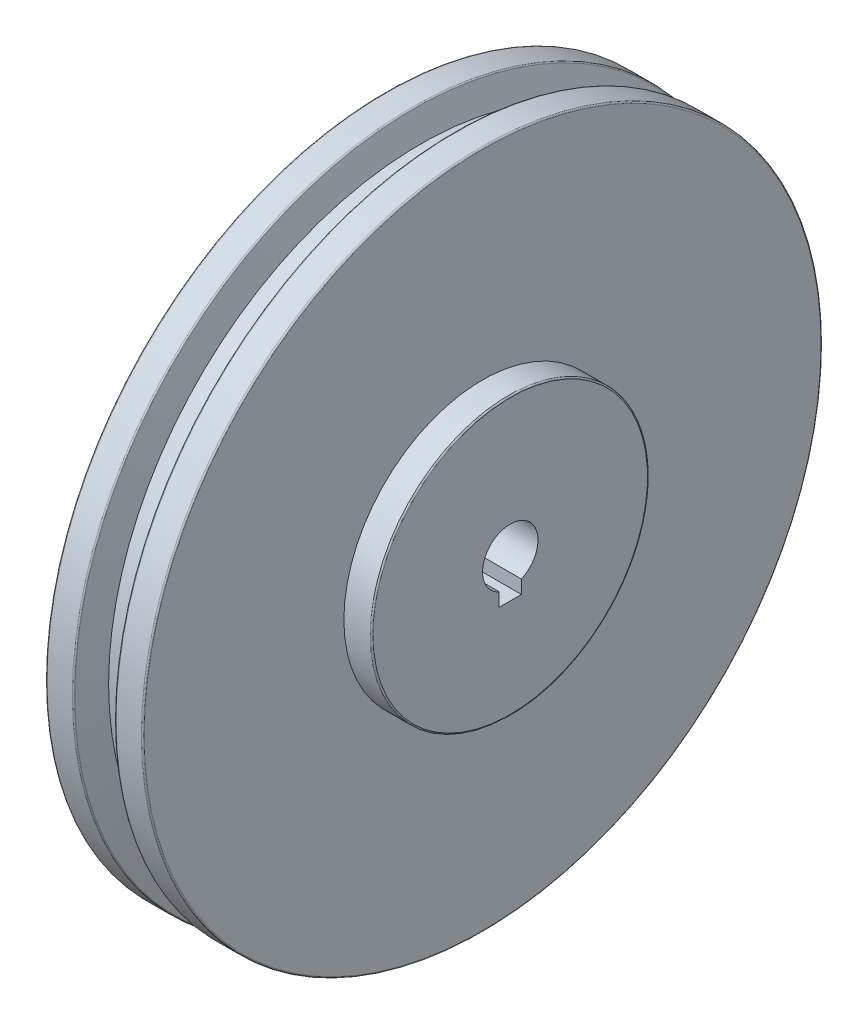
ISO-10303-21;
HEADER;
FILE_DESCRIPTION(('STEP AP214'),'2;1');
FILE_NAME('part.step','',(''),(''),'','','');
FILE_SCHEMA(('AUTOMOTIVE_DESIGN { 1 0 10303 214 1 1 1 1 }'));
ENDSEC;
DATA;
#1=APPLICATION_CONTEXT('core data for automotive mechanical design processes');
#2=APPLICATION_PROTOCOL_DEFINITION('international standard','automotive_design',2000,#1);
#3=PRODUCT_CONTEXT('',#1,'mechanical');
#4=PRODUCT('Part','Part','',(#3));
#5=PRODUCT_RELATED_PRODUCT_CATEGORY('part','',(#4));
#6=PRODUCT_DEFINITION_FORMATION('','',#4);
#7=PRODUCT_DEFINITION_CONTEXT('part definition',#1,'design');
#8=PRODUCT_DEFINITION('design','',#6,#7);
#9=PRODUCT_DEFINITION_SHAPE('','',#8);
#10=(LENGTH_UNIT() NAMED_UNIT(*) SI_UNIT(.MILLI.,.METRE.));
#11=(NAMED_UNIT(*) PLANE_ANGLE_UNIT() SI_UNIT($,.RADIAN.));
#12=(NAMED_UNIT(*) SI_UNIT($,.STERADIAN.) SOLID_ANGLE_UNIT());
#13=UNCERTAINTY_MEASURE_WITH_UNIT(LENGTH_MEASURE(1.E-05),#10,'distance_accuracy_value','');
#14=(GEOMETRIC_REPRESENTATION_CONTEXT(3) GLOBAL_UNCERTAINTY_ASSIGNED_CONTEXT((#13)) GLOBAL_UNIT_ASSIGNED_CONTEXT((#10,
#11,#12)) REPRESENTATION_CONTEXT('',''));
#15=CARTESIAN_POINT('',(0.,0.,0.));
#16=DIRECTION('',(0.,0.,1.));
#17=DIRECTION('',(1.,0.,0.));
#18=AXIS2_PLACEMENT_3D('',#15,#16,#17);
#19=CARTESIAN_POINT('',(2.5,0.,0.));
#20=DIRECTION('',(-1.,0.,0.));
#21=DIRECTION('',(0.,0.,1.));
#22=AXIS2_PLACEMENT_3D('',#19,#20,#21);
#23=CONICAL_SURFACE('',#22,10.,1.32581766366803);
#24=CARTESIAN_POINT('',(3.9982091334502,0.239497483998777,-4.));
#25=CARTESIAN_POINT('',(3.99949094210222,0.153874067113073,-4.));
#26=CARTESIAN_POINT('',(4.00008407993721,0.0682417266255501,-4.));
#27=CARTESIAN_POINT('',(3.99989702087461,-0.103020371462471,-4.));
#28=CARTESIAN_POINT('',(3.99911684151442,-0.188650129081989,-4.));
#29=CARTESIAN_POINT('',(3.99472310013969,-0.445464931331626,-4.));
#30=CARTESIAN_POINT('',(3.98905697783396,-0.616618759238255,-4.));
#31=CARTESIAN_POINT('',(3.97255266275997,-0.958361906247474,-4.));
#32=CARTESIAN_POINT('',(3.96172376166729,-1.12895168728123,-4.));
#33=CARTESIAN_POINT('',(3.9354004399075,-1.46977607446611,-4.));
#34=CARTESIAN_POINT('',(3.91990576144848,-1.64001066046866,-4.));
#35=CARTESIAN_POINT('',(3.88491349848852,-1.9795329334307,-4.));
#36=CARTESIAN_POINT('',(3.86542838707652,-2.14882192199654,-4.));
#37=CARTESIAN_POINT('',(3.8230443226964,-2.48696653471359,-4.));
#38=CARTESIAN_POINT('',(3.8001453990429,-2.65582216257344,-4.));
#39=CARTESIAN_POINT('',(3.7514931619618,-2.99321136452264,-4.));
#40=CARTESIAN_POINT('',(3.72573832003828,-3.16174471656856,-4.));
#41=CARTESIAN_POINT('',(3.67188320449087,-3.49843393520616,-4.));
#42=CARTESIAN_POINT('',(3.6437829319159,-3.66658980196661,-4.));
#43=CARTESIAN_POINT('',(3.5811609602192,-4.02856068825893,-4.));
#44=CARTESIAN_POINT('',(3.54631843748398,-4.22232001270321,-4.));
#45=CARTESIAN_POINT('',(3.47458420060922,-4.60945995883943,-4.));
#46=CARTESIAN_POINT('',(3.43769245490153,-4.80284057464985,-4.));
#47=CARTESIAN_POINT('',(3.32457410537635,-5.38252405884295,-4.));
#48=CARTESIAN_POINT('',(3.24590767658888,-5.76835006606814,-4.));
#49=CARTESIAN_POINT('',(3.08434301097601,-6.53908509686517,-4.));
#50=CARTESIAN_POINT('',(3.00144498038015,-6.92399416416948,-4.));
#51=CARTESIAN_POINT('',(2.83275823108083,-7.6931808752795,-4.));
#52=CARTESIAN_POINT('',(2.74696948235864,-8.07745851248461,-4.));
#53=CARTESIAN_POINT('',(2.57304572744791,-8.84696532269941,-4.));
#54=CARTESIAN_POINT('',(2.48490325790314,-9.23219280324941,-4.));
#55=CARTESIAN_POINT('',(2.30713409977689,-10.0023074018233,-4.));
#56=CARTESIAN_POINT('',(2.21750740089624,-10.3871945174658,-4.));
#57=CARTESIAN_POINT('',(1.94701138478034,-11.5414207532189,-4.));
#58=CARTESIAN_POINT('',(1.76451399424744,-12.3103779732623,-4.));
#59=CARTESIAN_POINT('',(1.44581148967251,-13.6434075397174,-4.));
#60=CARTESIAN_POINT('',(1.31019301606597,-14.2076207686432,-4.));
#61=CARTESIAN_POINT('',(1.03795243277761,-15.335805727838,-4.));
#62=CARTESIAN_POINT('',(0.901330322083348,-15.8997774578627,-4.));
#63=CARTESIAN_POINT('',(0.490372551565911,-17.5914572819046,-4.));
#64=CARTESIAN_POINT('',(0.214952258068573,-18.7189016820399,-4.));
#65=CARTESIAN_POINT('',(-0.335882183807941,-20.9665058719182,-4.));
#66=CARTESIAN_POINT('',(-0.611286131652636,-22.0866681655767,-4.));
#67=CARTESIAN_POINT('',(-1.02519143077604,-23.7666961745184,-4.));
#68=CARTESIAN_POINT('',(-1.16329094731863,-24.3266609305366,-4.));
#69=CARTESIAN_POINT('',(-1.4397123491927,-25.4465354051423,-4.));
#70=CARTESIAN_POINT('',(-1.57803423446698,-26.0064451237439,-4.));
#71=CARTESIAN_POINT('',(-1.71644459019244,-26.5663329597821,-4.));
#72=B_SPLINE_CURVE_WITH_KNOTS('',3,(#24,#25,#26,#27,#28,#29,#30,#31,#32,#33,#34,#35,#36,#37,#38,
#39,#40,#41,#42,#43,#44,#45,#46,#47,#48,#49,#50,#51,#52,#53,#54,#55,#56,#57,#58,#59,#60,#61,#62,
#63,#64,#65,#66,#67,#68,#69,#70,#71),.UNSPECIFIED.,.F.,.F.,(4,2,2,2,2,2,2,2,2,2,2,2,2,2,2,2,2,2,
2,2,2,2,2,4),(0.,0.256893529824105,0.513783779117827,1.02743456286781,1.54016437694349,
2.05292252538955,2.56410173536213,3.0752765560595,3.58672629165701,4.09817579852731,
4.68876292459129,5.27935915113827,6.46060795905571,7.64179925299349,8.82300281681761,
10.0085469531177,11.194099319443,13.5650403105444,15.3058902530148,17.046741951838,
20.528532750212,23.9890953920107,25.7193230936563,27.4495503503144),.UNSPECIFIED.);
#73=CARTESIAN_POINT('',(2.5,-9.16515138991168,-4.));
#74=VERTEX_POINT('',#73);
#75=CARTESIAN_POINT('',(1.35994505535974,-14.,-4.));
#76=VERTEX_POINT('',#75);
#77=EDGE_CURVE('E76',#74,#76,#72,.T.);
#78=ORIENTED_EDGE('',*,*,#77,.F.);
#79=CARTESIAN_POINT('',(2.5,0.,0.));
#80=DIRECTION('',(-1.,0.,0.));
#81=DIRECTION('',(0.,0.,1.));
#82=AXIS2_PLACEMENT_3D('',#79,#80,#81);
#83=CIRCLE('',#82,10.);
#84=CARTESIAN_POINT('',(2.5,-9.16515138991168,4.));
#85=VERTEX_POINT('',#84);
#86=EDGE_CURVE('E121',#85,#74,#83,.T.);
#87=ORIENTED_EDGE('',*,*,#86,.F.);
#88=CARTESIAN_POINT('',(-1.71644459019244,-26.5663329597821,4.));
#89=CARTESIAN_POINT('',(-1.57751969377818,-26.0043667723752,4.));
#90=CARTESIAN_POINT('',(-1.43868499306582,-25.4423783043008,4.));
#91=CARTESIAN_POINT('',(-1.16123979264955,-24.3183459035616,4.));
#92=CARTESIAN_POINT('',(-1.0226292929938,-23.7563019708847,4.));
#93=CARTESIAN_POINT('',(-0.607288678074337,-22.0704313359882,4.));
#94=CARTESIAN_POINT('',(-0.330960324651022,-20.9465055289346,4.));
#95=CARTESIAN_POINT('',(0.0821294794034745,-19.2608240092338,4.));
#96=CARTESIAN_POINT('',(0.219529000265815,-18.6992246777126,4.));
#97=CARTESIAN_POINT('',(0.493772689816105,-17.5758941779167,4.));
#98=CARTESIAN_POINT('',(0.630616862042874,-17.0141630105063,4.));
#99=CARTESIAN_POINT('',(0.903617140120429,-15.890351927177,4.));
#100=CARTESIAN_POINT('',(1.03977302333787,-15.3282719571445,4.));
#101=CARTESIAN_POINT('',(1.31109792963384,-14.2038597446444,4.));
#102=CARTESIAN_POINT('',(1.44626692946511,-13.6415274965631,4.));
#103=CARTESIAN_POINT('',(1.71190443452542,-12.5304024573386,4.));
#104=CARTESIAN_POINT('',(1.84240665654148,-11.9816177392138,4.));
#105=CARTESIAN_POINT('',(2.10150000005102,-10.8836455512106,4.));
#106=CARTESIAN_POINT('',(2.23009128117649,-10.334458119041,4.));
#107=CARTESIAN_POINT('',(2.48431808973877,-9.23591469077145,4.));
#108=CARTESIAN_POINT('',(2.60995616393847,-8.68655928729637,4.));
#109=CARTESIAN_POINT('',(2.79501440036432,-7.86167090201973,4.));
#110=CARTESIAN_POINT('',(2.85614345325827,-7.58652172450782,4.));
#111=CARTESIAN_POINT('',(2.97690982944825,-7.03589664987665,4.));
#112=CARTESIAN_POINT('',(3.03654715916062,-6.76042075416804,4.));
#113=CARTESIAN_POINT('',(3.15404729819923,-6.20820020881522,4.));
#114=CARTESIAN_POINT('',(3.21190405915624,-5.93145426811922,4.));
#115=CARTESIAN_POINT('',(3.32497988783636,-5.37742563860324,4.));
#116=CARTESIAN_POINT('',(3.38019899439789,-5.10014295774916,4.));
#117=CARTESIAN_POINT('',(3.48699754951729,-4.54513152584167,4.));
#118=CARTESIAN_POINT('',(3.5385802282393,-4.26740340063669,4.));
#119=CARTESIAN_POINT('',(3.6368012940884,-3.71103709337693,4.));
#120=CARTESIAN_POINT('',(3.68343922180667,-3.43239882923734,4.));
#121=CARTESIAN_POINT('',(3.77001140917091,-2.87304483489231,4.));
#122=CARTESIAN_POINT('',(3.80992103575625,-2.59232523808127,4.));
#123=CARTESIAN_POINT('',(3.88026936101606,-2.0297442741595,4.));
#124=CARTESIAN_POINT('',(3.91071093982709,-1.74788328073781,4.));
#125=CARTESIAN_POINT('',(3.94717948606759,-1.32385573252756,4.));
#126=CARTESIAN_POINT('',(3.95781286336694,-1.18208204216547,4.));
#127=CARTESIAN_POINT('',(3.97566723012114,-0.898319934403098,4.));
#128=CARTESIAN_POINT('',(3.9828883038966,-0.756331522395741,4.));
#129=CARTESIAN_POINT('',(3.99367170155033,-0.472061930913726,4.));
#130=CARTESIAN_POINT('',(3.99723009391394,-0.329780600766453,4.));
#131=CARTESIAN_POINT('',(4.00057456328787,-0.0451581924003093,4.));
#132=CARTESIAN_POINT('',(4.00036021993681,0.0971828907093948,4.));
#133=CARTESIAN_POINT('',(3.9982091334502,0.239497483998777,4.));
#134=B_SPLINE_CURVE_WITH_KNOTS('',3,(#88,#89,#90,#91,#92,#93,#94,#95,#96,#97,#98,#99,#100,#101,
#102,#103,#104,#105,#106,#107,#108,#109,#110,#111,#112,#113,#114,#115,#116,#117,#118,#119,#120,
#121,#122,#123,#124,#125,#126,#127,#128,#129,#130,#131,#132,#133),.UNSPECIFIED.,.F.,.F.,(4,2,2,
2,2,2,2,2,2,2,2,2,2,2,2,2,2,2,2,2,2,2,4),(0.,1.73665049204127,3.47330135715963,6.94548970452004,
8.67997845914833,10.4144561437719,12.1494629411391,13.8845104777251,15.5767725959689,
17.2688925459514,18.9594953364796,19.8050657824766,20.6506325908098,21.4988104952345,
22.3469759067211,23.194378161141,24.0418590774709,24.8923783344366,25.7426386137408,
26.1691196582863,26.5955901636103,27.0225179656139,27.4494933365723),.UNSPECIFIED.);
#135=CARTESIAN_POINT('',(1.35994505535974,-14.,4.));
#136=VERTEX_POINT('',#135);
#137=EDGE_CURVE('E48',#136,#85,#134,.T.);
#138=ORIENTED_EDGE('',*,*,#137,.F.);
#139=CARTESIAN_POINT('',(-0.594891303465912,-14.,-17.4598092532987));
#140=CARTESIAN_POINT('',(-0.477972715579384,-14.,-16.8601338890641));
#141=CARTESIAN_POINT('',(-0.363243172503584,-14.,-16.2600201503469));
#142=CARTESIAN_POINT('',(-0.139325616503206,-14.,-15.0587157594557));
#143=CARTESIAN_POINT('',(-0.0301380129904105,-14.,-14.4575250311057));
#144=CARTESIAN_POINT('',(0.181719173211806,-14.,-13.2527917699557));
#145=CARTESIAN_POINT('',(0.284375749699628,-14.,-12.6492469374648));
#146=CARTESIAN_POINT('',(0.481411871578671,-14.,-11.4408101833135));
#147=CARTESIAN_POINT('',(0.575791550070488,-14.,-10.8359182834757));
#148=CARTESIAN_POINT('',(0.753484434506258,-14.,-9.63120924080177));
#149=CARTESIAN_POINT('',(0.836906653915576,-14.,-9.03140829344529));
#150=CARTESIAN_POINT('',(0.991816572029047,-14.,-7.83027092000692));
#151=CARTESIAN_POINT('',(1.06330462555071,-14.,-7.22893454011522));
#152=CARTESIAN_POINT('',(1.19204784354924,-14.,-6.0252363726605));
#153=CARTESIAN_POINT('',(1.24931498707908,-14.,-5.42287588141449));
#154=CARTESIAN_POINT('',(1.34746133815216,-14.,-4.21680940724808));
#155=CARTESIAN_POINT('',(1.38834073742532,-14.,-3.6131034401523));
#156=CARTESIAN_POINT('',(1.45196506510539,-14.,-2.40183973962952));
#157=CARTESIAN_POINT('',(1.4746227797944,-14.,-1.79427734698979));
#158=CARTESIAN_POINT('',(1.50028301796892,-14.,-0.57873272586612));
#159=CARTESIAN_POINT('',(1.50328562343502,-14.,0.0292495008561282));
#160=CARTESIAN_POINT('',(1.4894644538347,-14.,1.24543634736847));
#161=CARTESIAN_POINT('',(1.4726259455166,-14.,1.85364079674026));
#162=CARTESIAN_POINT('',(1.42000768084097,-14.,3.06921490973008));
#163=CARTESIAN_POINT('',(1.38422793888616,-14.,3.67658457398253));
#164=CARTESIAN_POINT('',(1.29502128561865,-14.,4.89629777934016));
#165=CARTESIAN_POINT('',(1.24141639940646,-14.,5.50862811333251));
#166=CARTESIAN_POINT('',(1.11893548992387,-14.,6.73177923726777));
#167=CARTESIAN_POINT('',(1.05005846849383,-14.,7.34259992590323));
#168=CARTESIAN_POINT('',(0.899503005686127,-14.,8.56189526589394));
#169=CARTESIAN_POINT('',(0.817840208783739,-14.,9.17037186524913));
#170=CARTESIAN_POINT('',(0.687358843893016,-14.,10.081861928323));
#171=CARTESIAN_POINT('',(0.642538910998248,-14.,10.3854564619174));
#172=CARTESIAN_POINT('',(0.550477780967616,-14.,10.9922721314345));
#173=CARTESIAN_POINT('',(0.503236633691102,-14.,11.2954932749148));
#174=CARTESIAN_POINT('',(0.454905460304862,-14.,11.5985408563433));
#175=B_SPLINE_CURVE_WITH_KNOTS('',3,(#139,#140,#141,#142,#143,#144,#145,#146,#147,#148,#149,
#150,#151,#152,#153,#154,#155,#156,#157,#158,#159,#160,#161,#162,#163,#164,#165,#166,#167,#168,
#169,#170,#171,#172,#173,#174),.UNSPECIFIED.,.F.,.F.,(4,2,2,2,2,2,2,2,2,2,2,2,2,2,2,2,2,4),(0.,
1.83291351869371,3.66596224770601,5.50255396648862,7.33911614566646,9.1557408618982,
10.972311558008,12.7873468263189,14.6023608588383,16.4260111646082,18.2496538640086,
20.0746515845002,21.8996479172833,23.7434422441322,25.5873571136433,27.4290331803402,
28.3496807235931,29.2703093158355),.UNSPECIFIED.);
#176=EDGE_CURVE('E116',#76,#136,#175,.T.);
#177=ORIENTED_EDGE('',*,*,#176,.F.);
#178=EDGE_LOOP('',(#78,#87,#138,#177));
#179=FACE_BOUND('',#178,.T.);
#180=CARTESIAN_POINT('',(0.,0.,0.));
#181=DIRECTION('',(-1.,0.,0.));
#182=DIRECTION('',(0.,0.,1.));
#183=AXIS2_PLACEMENT_3D('',#180,#181,#182);
#184=CIRCLE('',#183,20.);
#185=CARTESIAN_POINT('',(0.,0.,20.));
#186=VERTEX_POINT('',#185);
#187=EDGE_CURVE('E164',#186,#186,#184,.T.);
#188=ORIENTED_EDGE('',*,*,#187,.T.);
#189=EDGE_LOOP('',(#188));
#190=FACE_BOUND('',#189,.T.);
#191=ADVANCED_FACE('F33',(#179,#190),#23,.F.);
#192=CARTESIAN_POINT('',(0.,-20.,0.));
#193=DIRECTION('',(-1.,0.,0.));
#194=DIRECTION('',(0.,0.,1.));
#195=AXIS2_PLACEMENT_3D('',#192,#193,#194);
#196=PLANE('',#195);
#197=CARTESIAN_POINT('',(0.,0.,0.));
#198=DIRECTION('',(-1.,0.,0.));
#199=DIRECTION('',(0.,0.,1.));
#200=AXIS2_PLACEMENT_3D('',#197,#198,#199);
#201=CIRCLE('',#200,122.);
#202=CARTESIAN_POINT('',(0.,0.,122.));
#203=VERTEX_POINT('',#202);
#204=EDGE_CURVE('E161',#203,#203,#201,.T.);
#205=ORIENTED_EDGE('',*,*,#204,.T.);
#206=EDGE_LOOP('',(#205));
#207=FACE_BOUND('',#206,.T.);
#208=ORIENTED_EDGE('',*,*,#187,.F.);
#209=EDGE_LOOP('',(#208));
#210=FACE_BOUND('',#209,.T.);
#211=ADVANCED_FACE('F172',(#207,#210),#196,.T.);
#212=CARTESIAN_POINT('',(0.500000000000013,0.,0.));
#213=DIRECTION('',(-1.,0.,0.));
#214=DIRECTION('',(0.,0.,1.));
#215=AXIS2_PLACEMENT_3D('',#212,#213,#214);
#216=TOROIDAL_SURFACE('',#215,122.,0.5);
#217=CARTESIAN_POINT('',(0.500000000000013,0.,0.));
#218=DIRECTION('',(-1.,0.,0.));
#219=DIRECTION('',(0.,0.,1.));
#220=AXIS2_PLACEMENT_3D('',#217,#218,#219);
#221=CIRCLE('',#220,122.5);
#222=CARTESIAN_POINT('',(0.500000000000013,0.,122.5));
#223=VERTEX_POINT('',#222);
#224=EDGE_CURVE('E158',#223,#223,#221,.T.);
#225=ORIENTED_EDGE('',*,*,#224,.T.);
#226=EDGE_LOOP('',(#225));
#227=FACE_BOUND('',#226,.T.);
#228=ORIENTED_EDGE('',*,*,#204,.F.);
#229=EDGE_LOOP('',(#228));
#230=FACE_BOUND('',#229,.T.);
#231=ADVANCED_FACE('F176',(#227,#230),#216,.T.);
#232=CARTESIAN_POINT('',(0.,0.,0.));
#233=DIRECTION('',(-1.,0.,0.));
#234=DIRECTION('',(0.,0.,1.));
#235=AXIS2_PLACEMENT_3D('',#232,#233,#234);
#236=CYLINDRICAL_SURFACE('',#235,122.5);
#237=CARTESIAN_POINT('',(9.61633650601052,0.,0.));
#238=DIRECTION('',(-1.,0.,0.));
#239=DIRECTION('',(0.,0.,1.));
#240=AXIS2_PLACEMENT_3D('',#237,#238,#239);
#241=CIRCLE('',#240,122.5);
#242=CARTESIAN_POINT('',(9.61633650601052,0.,122.5));
#243=VERTEX_POINT('',#242);
#244=EDGE_CURVE('E155',#243,#243,#241,.T.);
#245=ORIENTED_EDGE('',*,*,#244,.T.);
#246=EDGE_LOOP('',(#245));
#247=FACE_BOUND('',#246,.T.);
#248=ORIENTED_EDGE('',*,*,#224,.F.);
#249=EDGE_LOOP('',(#248));
#250=FACE_BOUND('',#249,.T.);
#251=ADVANCED_FACE('F181',(#247,#250),#236,.T.);
#252=CARTESIAN_POINT('',(9.61633650601052,0.,0.));
#253=DIRECTION('',(-1.,0.,0.));
#254=DIRECTION('',(0.,0.,1.));
#255=AXIS2_PLACEMENT_3D('',#252,#253,#254);
#256=TOROIDAL_SURFACE('',#255,122.,0.50000000000001);
#257=CARTESIAN_POINT('',(10.0992994191551,0.,0.));
#258=DIRECTION('',(-1.,0.,0.));
#259=DIRECTION('',(0.,0.,1.));
#260=AXIS2_PLACEMENT_3D('',#257,#258,#259);
#261=CIRCLE('',#260,122.129409522551);
#262=CARTESIAN_POINT('',(10.0992994191551,0.,122.129409522551));
#263=VERTEX_POINT('',#262);
#264=EDGE_CURVE('E152',#263,#263,#261,.T.);
#265=ORIENTED_EDGE('',*,*,#264,.T.);
#266=EDGE_LOOP('',(#265));
#267=FACE_BOUND('',#266,.T.);
#268=ORIENTED_EDGE('',*,*,#244,.F.);
#269=EDGE_LOOP('',(#268));
#270=FACE_BOUND('',#269,.T.);
#271=ADVANCED_FACE('F187',(#267,#270),#256,.T.);
#272=CARTESIAN_POINT('',(10.0992994191551,0.,0.));
#273=DIRECTION('',(-1.,0.,0.));
#274=DIRECTION('',(0.,0.,1.));
#275=AXIS2_PLACEMENT_3D('',#272,#273,#274);
#276=CONICAL_SURFACE('',#275,122.129409522551,1.30899693899575);
#277=CARTESIAN_POINT('',(12.6794919243112,0.,0.));
#278=DIRECTION('',(-1.,0.,0.));
#279=DIRECTION('',(0.,0.,1.));
#280=AXIS2_PLACEMENT_3D('',#277,#278,#279);
#281=CIRCLE('',#280,112.5);
#282=CARTESIAN_POINT('',(12.6794919243112,0.,112.5));
#283=VERTEX_POINT('',#282);
#284=EDGE_CURVE('E149',#283,#283,#281,.T.);
#285=ORIENTED_EDGE('',*,*,#284,.T.);
#286=EDGE_LOOP('',(#285));
#287=FACE_BOUND('',#286,.T.);
#288=ORIENTED_EDGE('',*,*,#264,.F.);
#289=EDGE_LOOP('',(#288));
#290=FACE_BOUND('',#289,.T.);
#291=ADVANCED_FACE('F191',(#287,#290),#276,.T.);
#292=CARTESIAN_POINT('',(0.,0.,0.));
#293=DIRECTION('',(-1.,0.,0.));
#294=DIRECTION('',(0.,0.,1.));
#295=AXIS2_PLACEMENT_3D('',#292,#293,#294);
#296=CYLINDRICAL_SURFACE('',#295,112.5);
#297=CARTESIAN_POINT('',(22.3205080756888,0.,0.));
#298=DIRECTION('',(-1.,0.,0.));
#299=DIRECTION('',(0.,0.,1.));
#300=AXIS2_PLACEMENT_3D('',#297,#298,#299);
#301=CIRCLE('',#300,112.5);
#302=CARTESIAN_POINT('',(22.3205080756888,0.,112.5));
#303=VERTEX_POINT('',#302);
#304=EDGE_CURVE('E146',#303,#303,#301,.T.);
#305=ORIENTED_EDGE('',*,*,#304,.T.);
#306=EDGE_LOOP('',(#305));
#307=FACE_BOUND('',#306,.T.);
#308=ORIENTED_EDGE('',*,*,#284,.F.);
#309=EDGE_LOOP('',(#308));
#310=FACE_BOUND('',#309,.T.);
#311=ADVANCED_FACE('F195',(#307,#310),#296,.T.);
#312=CARTESIAN_POINT('',(22.3205080756888,0.,0.));
#313=DIRECTION('',(1.,0.,0.));
#314=DIRECTION('',(0.,0.,-1.));
#315=AXIS2_PLACEMENT_3D('',#312,#313,#314);
#316=CONICAL_SURFACE('',#315,112.5,1.30899693899575);
#317=CARTESIAN_POINT('',(24.900700580845,0.,0.));
#318=DIRECTION('',(-1.,0.,0.));
#319=DIRECTION('',(0.,0.,1.));
#320=AXIS2_PLACEMENT_3D('',#317,#318,#319);
#321=CIRCLE('',#320,122.129409522551);
#322=CARTESIAN_POINT('',(24.900700580845,0.,122.129409522551));
#323=VERTEX_POINT('',#322);
#324=EDGE_CURVE('E143',#323,#323,#321,.T.);
#325=ORIENTED_EDGE('',*,*,#324,.T.);
#326=EDGE_LOOP('',(#325));
#327=FACE_BOUND('',#326,.T.);
#328=ORIENTED_EDGE('',*,*,#304,.F.);
#329=EDGE_LOOP('',(#328));
#330=FACE_BOUND('',#329,.T.);
#331=ADVANCED_FACE('F199',(#327,#330),#316,.T.);
#332=CARTESIAN_POINT('',(25.3836634939895,0.,0.));
#333=DIRECTION('',(-1.,0.,0.));
#334=DIRECTION('',(0.,0.,1.));
#335=AXIS2_PLACEMENT_3D('',#332,#333,#334);
#336=TOROIDAL_SURFACE('',#335,122.,0.500000000000012);
#337=CARTESIAN_POINT('',(25.3836634939895,0.,0.));
#338=DIRECTION('',(-1.,0.,0.));
#339=DIRECTION('',(0.,0.,1.));
#340=AXIS2_PLACEMENT_3D('',#337,#338,#339);
#341=CIRCLE('',#340,122.5);
#342=CARTESIAN_POINT('',(25.3836634939895,0.,122.5));
#343=VERTEX_POINT('',#342);
#344=EDGE_CURVE('E140',#343,#343,#341,.T.);
#345=ORIENTED_EDGE('',*,*,#344,.T.);
#346=EDGE_LOOP('',(#345));
#347=FACE_BOUND('',#346,.T.);
#348=ORIENTED_EDGE('',*,*,#324,.F.);
#349=EDGE_LOOP('',(#348));
#350=FACE_BOUND('',#349,.T.);
#351=ADVANCED_FACE('F203',(#347,#350),#336,.T.);
#352=CARTESIAN_POINT('',(0.,0.,0.));
#353=DIRECTION('',(-1.,0.,0.));
#354=DIRECTION('',(0.,0.,1.));
#355=AXIS2_PLACEMENT_3D('',#352,#353,#354);
#356=CYLINDRICAL_SURFACE('',#355,122.5);
#357=CARTESIAN_POINT('',(34.5,0.,0.));
#358=DIRECTION('',(-1.,0.,0.));
#359=DIRECTION('',(0.,0.,1.));
#360=AXIS2_PLACEMENT_3D('',#357,#358,#359);
#361=CIRCLE('',#360,122.5);
#362=CARTESIAN_POINT('',(34.5,0.,122.5));
#363=VERTEX_POINT('',#362);
#364=EDGE_CURVE('E137',#363,#363,#361,.T.);
#365=ORIENTED_EDGE('',*,*,#364,.T.);
#366=EDGE_LOOP('',(#365));
#367=FACE_BOUND('',#366,.T.);
#368=ORIENTED_EDGE('',*,*,#344,.F.);
#369=EDGE_LOOP('',(#368));
#370=FACE_BOUND('',#369,.T.);
#371=ADVANCED_FACE('F207',(#367,#370),#356,.T.);
#372=CARTESIAN_POINT('',(34.5,0.,0.));
#373=DIRECTION('',(-1.,0.,0.));
#374=DIRECTION('',(0.,0.,1.));
#375=AXIS2_PLACEMENT_3D('',#372,#373,#374);
#376=TOROIDAL_SURFACE('',#375,122.,0.500000000000007);
#377=CARTESIAN_POINT('',(35.,0.,0.));
#378=DIRECTION('',(-1.,0.,0.));
#379=DIRECTION('',(0.,0.,1.));
#380=AXIS2_PLACEMENT_3D('',#377,#378,#379);
#381=CIRCLE('',#380,122.);
#382=CARTESIAN_POINT('',(35.,0.,122.));
#383=VERTEX_POINT('',#382);
#384=EDGE_CURVE('E134',#383,#383,#381,.T.);
#385=ORIENTED_EDGE('',*,*,#384,.T.);
#386=EDGE_LOOP('',(#385));
#387=FACE_BOUND('',#386,.T.);
#388=ORIENTED_EDGE('',*,*,#364,.F.);
#389=EDGE_LOOP('',(#388));
#390=FACE_BOUND('',#389,.T.);
#391=ADVANCED_FACE('F211',(#387,#390),#376,.T.);
#392=CARTESIAN_POINT('',(35.,-122.,0.));
#393=DIRECTION('',(1.,0.,0.));
#394=DIRECTION('',(0.,0.,-1.));
#395=AXIS2_PLACEMENT_3D('',#392,#393,#394);
#396=PLANE('',#395);
#397=CARTESIAN_POINT('',(35.,0.,0.));
#398=DIRECTION('',(-1.,0.,0.));
#399=DIRECTION('',(0.,0.,1.));
#400=AXIS2_PLACEMENT_3D('',#397,#398,#399);
#401=CIRCLE('',#400,50.);
#402=CARTESIAN_POINT('',(35.,0.,50.));
#403=VERTEX_POINT('',#402);
#404=EDGE_CURVE('E131',#403,#403,#401,.T.);
#405=ORIENTED_EDGE('',*,*,#404,.T.);
#406=EDGE_LOOP('',(#405));
#407=FACE_BOUND('',#406,.T.);
#408=ORIENTED_EDGE('',*,*,#384,.F.);
#409=EDGE_LOOP('',(#408));
#410=FACE_BOUND('',#409,.T.);
#411=ADVANCED_FACE('F215',(#407,#410),#396,.T.);
#412=CARTESIAN_POINT('',(0.,0.,0.));
#413=DIRECTION('',(-1.,0.,0.));
#414=DIRECTION('',(0.,0.,1.));
#415=AXIS2_PLACEMENT_3D('',#412,#413,#414);
#416=CYLINDRICAL_SURFACE('',#415,50.);
#417=CARTESIAN_POINT('',(44.5,0.,0.));
#418=DIRECTION('',(-1.,0.,0.));
#419=DIRECTION('',(0.,0.,1.));
#420=AXIS2_PLACEMENT_3D('',#417,#418,#419);
#421=CIRCLE('',#420,50.);
#422=CARTESIAN_POINT('',(44.5,0.,50.));
#423=VERTEX_POINT('',#422);
#424=EDGE_CURVE('E128',#423,#423,#421,.T.);
#425=ORIENTED_EDGE('',*,*,#424,.T.);
#426=EDGE_LOOP('',(#425));
#427=FACE_BOUND('',#426,.T.);
#428=ORIENTED_EDGE('',*,*,#404,.F.);
#429=EDGE_LOOP('',(#428));
#430=FACE_BOUND('',#429,.T.);
#431=ADVANCED_FACE('F219',(#427,#430),#416,.T.);
#432=CARTESIAN_POINT('',(44.5,0.,0.));
#433=DIRECTION('',(-1.,0.,0.));
#434=DIRECTION('',(0.,0.,1.));
#435=AXIS2_PLACEMENT_3D('',#432,#433,#434);
#436=TOROIDAL_SURFACE('',#435,49.5,0.499999999999997);
#437=CARTESIAN_POINT('',(45.,0.,0.));
#438=DIRECTION('',(-1.,0.,0.));
#439=DIRECTION('',(0.,0.,1.));
#440=AXIS2_PLACEMENT_3D('',#437,#438,#439);
#441=CIRCLE('',#440,49.5);
#442=CARTESIAN_POINT('',(45.,0.,49.5));
#443=VERTEX_POINT('',#442);
#444=EDGE_CURVE('E125',#443,#443,#441,.T.);
#445=ORIENTED_EDGE('',*,*,#444,.T.);
#446=EDGE_LOOP('',(#445));
#447=FACE_BOUND('',#446,.T.);
#448=ORIENTED_EDGE('',*,*,#424,.F.);
#449=EDGE_LOOP('',(#448));
#450=FACE_BOUND('',#449,.T.);
#451=ADVANCED_FACE('F223',(#447,#450),#436,.T.);
#452=CARTESIAN_POINT('',(45.,-49.5,0.));
#453=DIRECTION('',(1.,0.,0.));
#454=DIRECTION('',(0.,0.,-1.));
#455=AXIS2_PLACEMENT_3D('',#452,#453,#454);
#456=PLANE('',#455);
#457=DIRECTION('',(0.,-1.,0.));
#458=VECTOR('',#457,1.);
#459=CARTESIAN_POINT('',(45.,-14.,-4.));
#460=LINE('',#459,#458);
#461=CARTESIAN_POINT('',(45.,-9.16515138991168,-4.));
#462=VERTEX_POINT('',#461);
#463=CARTESIAN_POINT('',(45.,-14.,-4.));
#464=VERTEX_POINT('',#463);
#465=EDGE_CURVE('E75',#462,#464,#460,.T.);
#466=ORIENTED_EDGE('',*,*,#465,.T.);
#467=DIRECTION('',(0.,0.,1.));
#468=VECTOR('',#467,1.);
#469=CARTESIAN_POINT('',(45.,-14.,4.));
#470=LINE('',#469,#468);
#471=CARTESIAN_POINT('',(45.,-14.,4.));
#472=VERTEX_POINT('',#471);
#473=EDGE_CURVE('E83',#464,#472,#470,.T.);
#474=ORIENTED_EDGE('',*,*,#473,.T.);
#475=DIRECTION('',(0.,1.,0.));
#476=VECTOR('',#475,1.);
#477=CARTESIAN_POINT('',(45.,-14.,4.));
#478=LINE('',#477,#476);
#479=CARTESIAN_POINT('',(45.,-9.16515138991168,4.));
#480=VERTEX_POINT('',#479);
#481=EDGE_CURVE('E80',#472,#480,#478,.T.);
#482=ORIENTED_EDGE('',*,*,#481,.T.);
#483=CARTESIAN_POINT('',(45.,0.,0.));
#484=DIRECTION('',(-1.,0.,0.));
#485=DIRECTION('',(0.,0.,1.));
#486=AXIS2_PLACEMENT_3D('',#483,#484,#485);
#487=CIRCLE('',#486,10.);
#488=EDGE_CURVE('E93',#480,#462,#487,.T.);
#489=ORIENTED_EDGE('',*,*,#488,.T.);
#490=EDGE_LOOP('',(#466,#474,#482,#489));
#491=FACE_BOUND('',#490,.T.);
#492=ORIENTED_EDGE('',*,*,#444,.F.);
#493=EDGE_LOOP('',(#492));
#494=FACE_BOUND('',#493,.T.);
#495=ADVANCED_FACE('F90',(#491,#494),#456,.T.);
#496=CARTESIAN_POINT('',(0.,0.,0.));
#497=DIRECTION('',(-1.,0.,0.));
#498=DIRECTION('',(0.,0.,1.));
#499=AXIS2_PLACEMENT_3D('',#496,#497,#498);
#500=CYLINDRICAL_SURFACE('',#499,10.);
#501=DIRECTION('',(-1.,0.,0.));
#502=VECTOR('',#501,1.);
#503=CARTESIAN_POINT('',(0.,-9.16515138991168,-4.));
#504=LINE('',#503,#502);
#505=EDGE_CURVE('E11',#462,#74,#504,.T.);
#506=ORIENTED_EDGE('',*,*,#505,.F.);
#507=ORIENTED_EDGE('',*,*,#488,.F.);
#508=DIRECTION('',(-1.,0.,0.));
#509=VECTOR('',#508,1.);
#510=CARTESIAN_POINT('',(0.,-9.16515138991168,4.));
#511=LINE('',#510,#509);
#512=EDGE_CURVE('E41',#85,#480,#511,.F.);
#513=ORIENTED_EDGE('',*,*,#512,.F.);
#514=ORIENTED_EDGE('',*,*,#86,.T.);
#515=EDGE_LOOP('',(#506,#507,#513,#514));
#516=FACE_BOUND('',#515,.T.);
#517=ADVANCED_FACE('F168',(#516),#500,.F.);
#518=CARTESIAN_POINT('',(45.,-14.,-4.));
#519=DIRECTION('',(0.,0.,-1.));
#520=DIRECTION('',(-1.,0.,0.));
#521=AXIS2_PLACEMENT_3D('',#518,#519,#520);
#522=PLANE('',#521);
#523=ORIENTED_EDGE('',*,*,#77,.T.);
#524=DIRECTION('',(-1.,0.,0.));
#525=VECTOR('',#524,1.);
#526=CARTESIAN_POINT('',(45.,-14.,-4.));
#527=LINE('',#526,#525);
#528=EDGE_CURVE('E71',#464,#76,#527,.T.);
#529=ORIENTED_EDGE('',*,*,#528,.F.);
#530=ORIENTED_EDGE('',*,*,#465,.F.);
#531=ORIENTED_EDGE('',*,*,#505,.T.);
#532=EDGE_LOOP('',(#523,#529,#530,#531));
#533=FACE_BOUND('',#532,.T.);
#534=ADVANCED_FACE('F73',(#533),#522,.F.);
#535=CARTESIAN_POINT('',(45.,-14.,4.));
#536=DIRECTION('',(0.,0.,1.));
#537=DIRECTION('',(1.,0.,0.));
#538=AXIS2_PLACEMENT_3D('',#535,#536,#537);
#539=PLANE('',#538);
#540=ORIENTED_EDGE('',*,*,#137,.T.);
#541=ORIENTED_EDGE('',*,*,#512,.T.);
#542=ORIENTED_EDGE('',*,*,#481,.F.);
#543=DIRECTION('',(-1.,0.,0.));
#544=VECTOR('',#543,1.);
#545=CARTESIAN_POINT('',(45.,-14.,4.));
#546=LINE('',#545,#544);
#547=EDGE_CURVE('E79',#472,#136,#546,.T.);
#548=ORIENTED_EDGE('',*,*,#547,.T.);
#549=EDGE_LOOP('',(#540,#541,#542,#548));
#550=FACE_BOUND('',#549,.T.);
#551=ADVANCED_FACE('F108',(#550),#539,.F.);
#552=CARTESIAN_POINT('',(45.,-14.,4.));
#553=DIRECTION('',(0.,-1.,0.));
#554=DIRECTION('',(0.,0.,-1.));
#555=AXIS2_PLACEMENT_3D('',#552,#553,#554);
#556=PLANE('',#555);
#557=ORIENTED_EDGE('',*,*,#176,.T.);
#558=ORIENTED_EDGE('',*,*,#547,.F.);
#559=ORIENTED_EDGE('',*,*,#473,.F.);
#560=ORIENTED_EDGE('',*,*,#528,.T.);
#561=EDGE_LOOP('',(#557,#558,#559,#560));
#562=FACE_BOUND('',#561,.T.);
#563=ADVANCED_FACE('F84',(#562),#556,.F.);
#564=CLOSED_SHELL('',(#191,#211,#231,#251,#271,#291,#311,#331,#351,#371,#391,#411,#431,#451,
#495,#517,#534,#551,#563));
#565=MANIFOLD_SOLID_BREP('B2',#564);
#566=ADVANCED_BREP_SHAPE_REPRESENTATION('',(#18,#565),#14);
#567=SHAPE_DEFINITION_REPRESENTATION(#9,#566);
ENDSEC;
END-ISO-10303-21;
